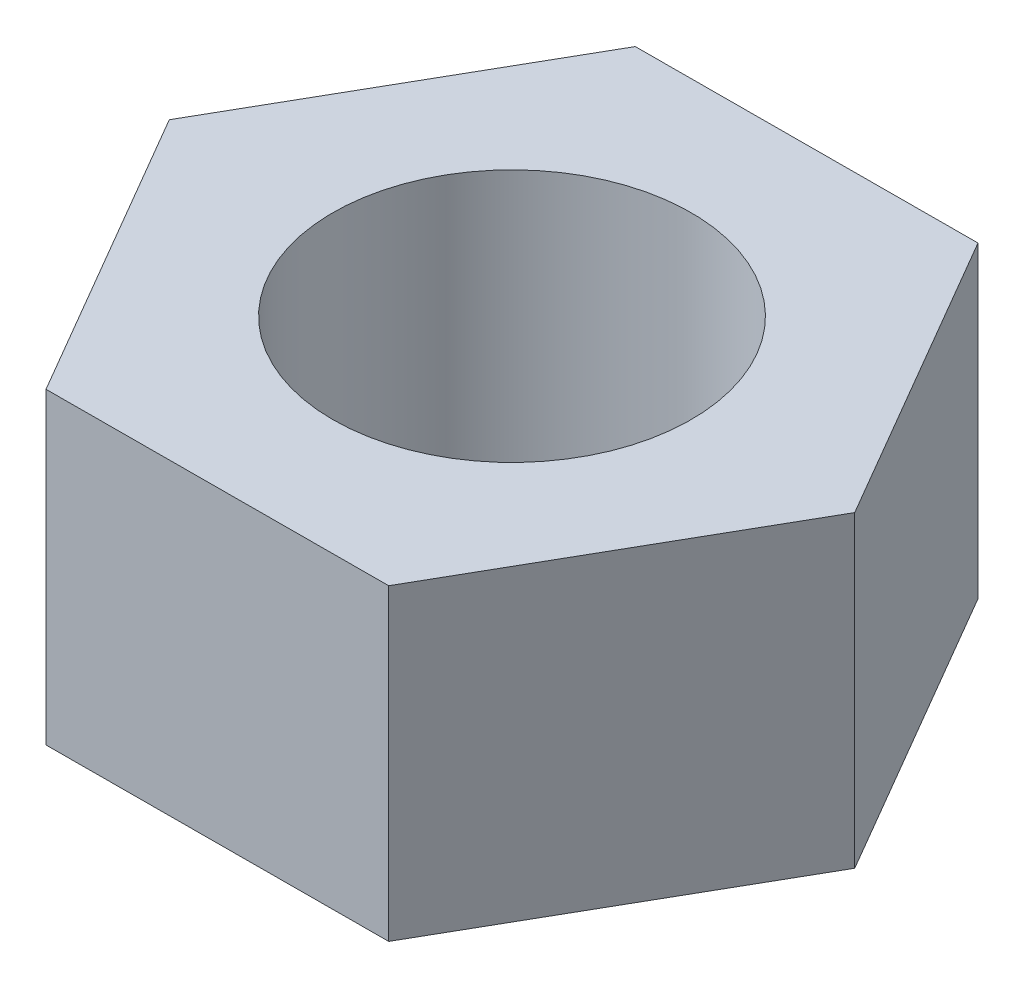
ISO-10303-21;
HEADER;
FILE_DESCRIPTION(('STEP AP214'),'2;1');
FILE_NAME('part.step','',(''),(''),'','','');
FILE_SCHEMA(('AUTOMOTIVE_DESIGN { 1 0 10303 214 1 1 1 1 }'));
ENDSEC;
DATA;
#1=APPLICATION_CONTEXT('core data for automotive mechanical design processes');
#2=APPLICATION_PROTOCOL_DEFINITION('international standard','automotive_design',2000,#1);
#3=PRODUCT_CONTEXT('',#1,'mechanical');
#4=PRODUCT('Part','Part','',(#3));
#5=PRODUCT_RELATED_PRODUCT_CATEGORY('part','',(#4));
#6=PRODUCT_DEFINITION_FORMATION('','',#4);
#7=PRODUCT_DEFINITION_CONTEXT('part definition',#1,'design');
#8=PRODUCT_DEFINITION('design','',#6,#7);
#9=PRODUCT_DEFINITION_SHAPE('','',#8);
#10=(LENGTH_UNIT() NAMED_UNIT(*) SI_UNIT(.MILLI.,.METRE.));
#11=(NAMED_UNIT(*) PLANE_ANGLE_UNIT() SI_UNIT($,.RADIAN.));
#12=(NAMED_UNIT(*) SI_UNIT($,.STERADIAN.) SOLID_ANGLE_UNIT());
#13=UNCERTAINTY_MEASURE_WITH_UNIT(LENGTH_MEASURE(1.E-05),#10,'distance_accuracy_value','');
#14=(GEOMETRIC_REPRESENTATION_CONTEXT(3) GLOBAL_UNCERTAINTY_ASSIGNED_CONTEXT((#13)) GLOBAL_UNIT_ASSIGNED_CONTEXT((#10,
#11,#12)) REPRESENTATION_CONTEXT('',''));
#15=CARTESIAN_POINT('',(0.,0.,0.));
#16=DIRECTION('',(0.,0.,1.));
#17=DIRECTION('',(1.,0.,0.));
#18=AXIS2_PLACEMENT_3D('',#15,#16,#17);
#19=CARTESIAN_POINT('',(15.48581609446,13.97,-0.0566904627170724));
#20=DIRECTION('',(-0.864189213523948,0.,0.503166973507662));
#21=DIRECTION('',(0.503166973507662,0.,0.864189213523948));
#22=AXIS2_PLACEMENT_3D('',#19,#20,#21);
#23=PLANE('',#22);
#24=DIRECTION('',(-0.503166973507662,0.,-0.864189213523948));
#25=VECTOR('',#24,1.);
#26=CARTESIAN_POINT('',(15.48581609446,0.,-0.0566904627170724));
#27=LINE('',#26,#25);
#28=CARTESIAN_POINT('',(15.48581609446,0.,-0.0566904627170724));
#29=VERTEX_POINT('',#28);
#30=CARTESIAN_POINT('',(7.69381266636473,0.,-13.4394553674948));
#31=VERTEX_POINT('',#30);
#32=EDGE_CURVE('E132',#29,#31,#27,.T.);
#33=ORIENTED_EDGE('',*,*,#32,.T.);
#34=DIRECTION('',(0.,-1.,0.));
#35=VECTOR('',#34,1.);
#36=CARTESIAN_POINT('',(7.69381266636473,13.97,-13.4394553674948));
#37=LINE('',#36,#35);
#38=CARTESIAN_POINT('',(7.69381266636473,13.97,-13.4394553674948));
#39=VERTEX_POINT('',#38);
#40=EDGE_CURVE('E11',#39,#31,#37,.T.);
#41=ORIENTED_EDGE('',*,*,#40,.F.);
#42=DIRECTION('',(-0.503166973507662,0.,-0.864189213523948));
#43=VECTOR('',#42,1.);
#44=CARTESIAN_POINT('',(15.48581609446,13.97,-0.0566904627170724));
#45=LINE('',#44,#43);
#46=CARTESIAN_POINT('',(15.48581609446,13.97,-0.0566904627170724));
#47=VERTEX_POINT('',#46);
#48=EDGE_CURVE('E149',#47,#39,#45,.T.);
#49=ORIENTED_EDGE('',*,*,#48,.F.);
#50=DIRECTION('',(0.,-1.,0.));
#51=VECTOR('',#50,1.);
#52=CARTESIAN_POINT('',(15.48581609446,13.97,-0.0566904627170724));
#53=LINE('',#52,#51);
#54=EDGE_CURVE('E128',#47,#29,#53,.T.);
#55=ORIENTED_EDGE('',*,*,#54,.T.);
#56=EDGE_LOOP('',(#33,#41,#49,#55));
#57=FACE_BOUND('',#56,.T.);
#58=ADVANCED_FACE('F43',(#57),#23,.F.);
#59=CARTESIAN_POINT('',(7.69381266636473,13.97,-13.4394553674948));
#60=DIRECTION('',(0.00366077464099213,0.,0.999993299342064));
#61=DIRECTION('',(0.999993299342064,0.,-0.00366077464099213));
#62=AXIS2_PLACEMENT_3D('',#59,#60,#61);
#63=PLANE('',#62);
#64=DIRECTION('',(-0.999993299342064,0.,0.00366077464099213));
#65=VECTOR('',#64,1.);
#66=CARTESIAN_POINT('',(7.69381266636473,0.,-13.4394553674948));
#67=LINE('',#66,#65);
#68=CARTESIAN_POINT('',(-7.79200342809529,0.,-13.3827649047778));
#69=VERTEX_POINT('',#68);
#70=EDGE_CURVE('E136',#31,#69,#67,.T.);
#71=ORIENTED_EDGE('',*,*,#70,.T.);
#72=DIRECTION('',(0.,-1.,0.));
#73=VECTOR('',#72,1.);
#74=CARTESIAN_POINT('',(-7.79200342809529,13.97,-13.3827649047778));
#75=LINE('',#74,#73);
#76=CARTESIAN_POINT('',(-7.79200342809529,13.97,-13.3827649047778));
#77=VERTEX_POINT('',#76);
#78=EDGE_CURVE('E52',#77,#69,#75,.T.);
#79=ORIENTED_EDGE('',*,*,#78,.F.);
#80=DIRECTION('',(-0.999993299342064,0.,0.00366077464099213));
#81=VECTOR('',#80,1.);
#82=CARTESIAN_POINT('',(7.69381266636473,13.97,-13.4394553674948));
#83=LINE('',#82,#81);
#84=EDGE_CURVE('E97',#39,#77,#83,.T.);
#85=ORIENTED_EDGE('',*,*,#84,.F.);
#86=ORIENTED_EDGE('',*,*,#40,.T.);
#87=EDGE_LOOP('',(#71,#79,#85,#86));
#88=FACE_BOUND('',#87,.T.);
#89=ADVANCED_FACE('F178',(#88),#63,.F.);
#90=CARTESIAN_POINT('',(-7.79200342809529,13.97,-13.3827649047778));
#91=DIRECTION('',(0.867849988164941,0.,0.496826325834403));
#92=DIRECTION('',(0.496826325834403,0.,-0.867849988164941));
#93=AXIS2_PLACEMENT_3D('',#90,#91,#92);
#94=PLANE('',#93);
#95=DIRECTION('',(-0.496826325834403,0.,0.867849988164941));
#96=VECTOR('',#95,1.);
#97=CARTESIAN_POINT('',(-7.79200342809529,0.,-13.3827649047778));
#98=LINE('',#97,#96);
#99=CARTESIAN_POINT('',(-15.48581609446,0.,0.0566904627170724));
#100=VERTEX_POINT('',#99);
#101=EDGE_CURVE('E140',#69,#100,#98,.T.);
#102=ORIENTED_EDGE('',*,*,#101,.T.);
#103=DIRECTION('',(0.,-1.,0.));
#104=VECTOR('',#103,1.);
#105=CARTESIAN_POINT('',(-15.48581609446,13.97,0.0566904627170724));
#106=LINE('',#105,#104);
#107=CARTESIAN_POINT('',(-15.48581609446,13.97,0.0566904627170724));
#108=VERTEX_POINT('',#107);
#109=EDGE_CURVE('E121',#108,#100,#106,.T.);
#110=ORIENTED_EDGE('',*,*,#109,.F.);
#111=DIRECTION('',(-0.496826325834403,0.,0.867849988164941));
#112=VECTOR('',#111,1.);
#113=CARTESIAN_POINT('',(-7.79200342809529,13.97,-13.3827649047778));
#114=LINE('',#113,#112);
#115=EDGE_CURVE('E110',#77,#108,#114,.T.);
#116=ORIENTED_EDGE('',*,*,#115,.F.);
#117=ORIENTED_EDGE('',*,*,#78,.T.);
#118=EDGE_LOOP('',(#102,#110,#116,#117));
#119=FACE_BOUND('',#118,.T.);
#120=ADVANCED_FACE('F159',(#119),#94,.F.);
#121=CARTESIAN_POINT('',(-15.48581609446,13.97,0.0566904627170724));
#122=DIRECTION('',(0.864189213523948,0.,-0.503166973507662));
#123=DIRECTION('',(-0.503166973507662,0.,-0.864189213523948));
#124=AXIS2_PLACEMENT_3D('',#121,#122,#123);
#125=PLANE('',#124);
#126=DIRECTION('',(0.503166973507662,0.,0.864189213523948));
#127=VECTOR('',#126,1.);
#128=CARTESIAN_POINT('',(-15.48581609446,0.,0.0566904627170724));
#129=LINE('',#128,#127);
#130=CARTESIAN_POINT('',(-7.69381266636472,0.,13.4394553674948));
#131=VERTEX_POINT('',#130);
#132=EDGE_CURVE('E119',#100,#131,#129,.T.);
#133=ORIENTED_EDGE('',*,*,#132,.T.);
#134=DIRECTION('',(0.,-1.,0.));
#135=VECTOR('',#134,1.);
#136=CARTESIAN_POINT('',(-7.69381266636472,13.97,13.4394553674948));
#137=LINE('',#136,#135);
#138=CARTESIAN_POINT('',(-7.69381266636472,13.97,13.4394553674948));
#139=VERTEX_POINT('',#138);
#140=EDGE_CURVE('E116',#139,#131,#137,.T.);
#141=ORIENTED_EDGE('',*,*,#140,.F.);
#142=DIRECTION('',(0.503166973507662,0.,0.864189213523948));
#143=VECTOR('',#142,1.);
#144=CARTESIAN_POINT('',(-15.48581609446,13.97,0.0566904627170724));
#145=LINE('',#144,#143);
#146=EDGE_CURVE('E104',#108,#139,#145,.T.);
#147=ORIENTED_EDGE('',*,*,#146,.F.);
#148=ORIENTED_EDGE('',*,*,#109,.T.);
#149=EDGE_LOOP('',(#133,#141,#147,#148));
#150=FACE_BOUND('',#149,.T.);
#151=ADVANCED_FACE('F117',(#150),#125,.F.);
#152=CARTESIAN_POINT('',(-7.69381266636472,13.97,13.4394553674948));
#153=DIRECTION('',(-0.00366077464099191,0.,-0.999993299342065));
#154=DIRECTION('',(-0.999993299342065,0.,0.00366077464099191));
#155=AXIS2_PLACEMENT_3D('',#152,#153,#154);
#156=PLANE('',#155);
#157=DIRECTION('',(0.999993299342065,0.,-0.00366077464099191));
#158=VECTOR('',#157,1.);
#159=CARTESIAN_POINT('',(-7.69381266636472,0.,13.4394553674948));
#160=LINE('',#159,#158);
#161=CARTESIAN_POINT('',(7.79200342809529,0.,13.3827649047778));
#162=VERTEX_POINT('',#161);
#163=EDGE_CURVE('E83',#131,#162,#160,.T.);
#164=ORIENTED_EDGE('',*,*,#163,.T.);
#165=DIRECTION('',(0.,-1.,0.));
#166=VECTOR('',#165,1.);
#167=CARTESIAN_POINT('',(7.79200342809529,13.97,13.3827649047778));
#168=LINE('',#167,#166);
#169=CARTESIAN_POINT('',(7.79200342809529,13.97,13.3827649047778));
#170=VERTEX_POINT('',#169);
#171=EDGE_CURVE('E122',#170,#162,#168,.T.);
#172=ORIENTED_EDGE('',*,*,#171,.F.);
#173=DIRECTION('',(0.999993299342065,0.,-0.00366077464099191));
#174=VECTOR('',#173,1.);
#175=CARTESIAN_POINT('',(-7.69381266636472,13.97,13.4394553674948));
#176=LINE('',#175,#174);
#177=EDGE_CURVE('E108',#139,#170,#176,.T.);
#178=ORIENTED_EDGE('',*,*,#177,.F.);
#179=ORIENTED_EDGE('',*,*,#140,.T.);
#180=EDGE_LOOP('',(#164,#172,#178,#179));
#181=FACE_BOUND('',#180,.T.);
#182=ADVANCED_FACE('F124',(#181),#156,.F.);
#183=CARTESIAN_POINT('',(7.79200342809529,13.97,13.3827649047778));
#184=DIRECTION('',(-0.867849988164941,0.,-0.496826325834403));
#185=DIRECTION('',(-0.496826325834403,0.,0.867849988164941));
#186=AXIS2_PLACEMENT_3D('',#183,#184,#185);
#187=PLANE('',#186);
#188=DIRECTION('',(0.496826325834403,0.,-0.867849988164941));
#189=VECTOR('',#188,1.);
#190=CARTESIAN_POINT('',(7.79200342809529,0.,13.3827649047778));
#191=LINE('',#190,#189);
#192=EDGE_CURVE('E89',#162,#29,#191,.T.);
#193=ORIENTED_EDGE('',*,*,#192,.T.);
#194=ORIENTED_EDGE('',*,*,#54,.F.);
#195=DIRECTION('',(0.496826325834403,0.,-0.867849988164941));
#196=VECTOR('',#195,1.);
#197=CARTESIAN_POINT('',(7.79200342809529,13.97,13.3827649047778));
#198=LINE('',#197,#196);
#199=EDGE_CURVE('E60',#170,#47,#198,.T.);
#200=ORIENTED_EDGE('',*,*,#199,.F.);
#201=ORIENTED_EDGE('',*,*,#171,.T.);
#202=EDGE_LOOP('',(#193,#194,#200,#201));
#203=FACE_BOUND('',#202,.T.);
#204=ADVANCED_FACE('F166',(#203),#187,.F.);
#205=CARTESIAN_POINT('',(0.,13.97,0.));
#206=DIRECTION('',(0.,1.,0.));
#207=DIRECTION('',(0.,0.,1.));
#208=AXIS2_PLACEMENT_3D('',#205,#206,#207);
#209=PLANE('',#208);
#210=CARTESIAN_POINT('',(0.,13.97,0.));
#211=DIRECTION('',(0.,1.,0.));
#212=DIRECTION('',(0.,0.,1.));
#213=AXIS2_PLACEMENT_3D('',#210,#211,#212);
#214=CIRCLE('',#213,8.128);
#215=CARTESIAN_POINT('',(0.,13.97,8.128));
#216=VERTEX_POINT('',#215);
#217=EDGE_CURVE('E265',#216,#216,#214,.T.);
#218=ORIENTED_EDGE('',*,*,#217,.F.);
#219=EDGE_LOOP('',(#218));
#220=FACE_BOUND('',#219,.T.);
#221=ORIENTED_EDGE('',*,*,#48,.T.);
#222=ORIENTED_EDGE('',*,*,#84,.T.);
#223=ORIENTED_EDGE('',*,*,#115,.T.);
#224=ORIENTED_EDGE('',*,*,#146,.T.);
#225=ORIENTED_EDGE('',*,*,#177,.T.);
#226=ORIENTED_EDGE('',*,*,#199,.T.);
#227=EDGE_LOOP('',(#221,#222,#223,#224,#225,#226));
#228=FACE_BOUND('',#227,.T.);
#229=ADVANCED_FACE('F106',(#220,#228),#209,.T.);
#230=CARTESIAN_POINT('',(0.,0.,0.));
#231=DIRECTION('',(0.,1.,0.));
#232=DIRECTION('',(0.,0.,1.));
#233=AXIS2_PLACEMENT_3D('',#230,#231,#232);
#234=PLANE('',#233);
#235=CARTESIAN_POINT('',(0.,0.,0.));
#236=DIRECTION('',(0.,1.,0.));
#237=DIRECTION('',(0.,0.,1.));
#238=AXIS2_PLACEMENT_3D('',#235,#236,#237);
#239=CIRCLE('',#238,8.128);
#240=CARTESIAN_POINT('',(0.,0.,8.128));
#241=VERTEX_POINT('',#240);
#242=EDGE_CURVE('E137',#241,#241,#239,.T.);
#243=ORIENTED_EDGE('',*,*,#242,.T.);
#244=EDGE_LOOP('',(#243));
#245=FACE_BOUND('',#244,.T.);
#246=ORIENTED_EDGE('',*,*,#32,.F.);
#247=ORIENTED_EDGE('',*,*,#192,.F.);
#248=ORIENTED_EDGE('',*,*,#163,.F.);
#249=ORIENTED_EDGE('',*,*,#132,.F.);
#250=ORIENTED_EDGE('',*,*,#101,.F.);
#251=ORIENTED_EDGE('',*,*,#70,.F.);
#252=EDGE_LOOP('',(#246,#247,#248,#249,#250,#251));
#253=FACE_BOUND('',#252,.T.);
#254=ADVANCED_FACE('F162',(#245,#253),#234,.F.);
#255=CARTESIAN_POINT('',(0.,0.,0.));
#256=DIRECTION('',(0.,1.,0.));
#257=DIRECTION('',(0.,0.,1.));
#258=AXIS2_PLACEMENT_3D('',#255,#256,#257);
#259=CYLINDRICAL_SURFACE('',#258,8.128);
#260=ORIENTED_EDGE('',*,*,#242,.F.);
#261=EDGE_LOOP('',(#260));
#262=FACE_BOUND('',#261,.T.);
#263=ORIENTED_EDGE('',*,*,#217,.T.);
#264=EDGE_LOOP('',(#263));
#265=FACE_BOUND('',#264,.T.);
#266=ADVANCED_FACE('F218',(#262,#265),#259,.F.);
#267=CLOSED_SHELL('',(#58,#89,#120,#151,#182,#204,#229,#254,#266));
#268=MANIFOLD_SOLID_BREP('B2',#267);
#269=ADVANCED_BREP_SHAPE_REPRESENTATION('',(#18,#268),#14);
#270=SHAPE_DEFINITION_REPRESENTATION(#9,#269);
ENDSEC;
END-ISO-10303-21;
